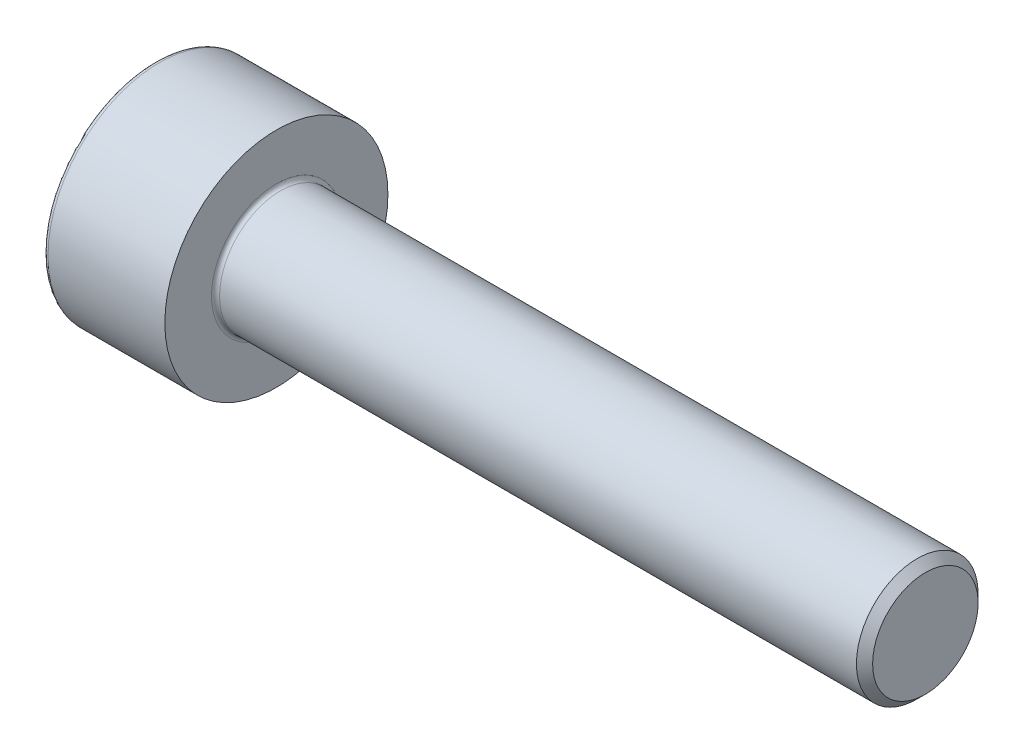
ISO-10303-21;
HEADER;
FILE_DESCRIPTION(('STEP AP214'),'2;1');
FILE_NAME('part.step','',(''),(''),'','','');
FILE_SCHEMA(('AUTOMOTIVE_DESIGN { 1 0 10303 214 1 1 1 1 }'));
ENDSEC;
DATA;
#1=APPLICATION_CONTEXT('core data for automotive mechanical design processes');
#2=APPLICATION_PROTOCOL_DEFINITION('international standard','automotive_design',2000,#1);
#3=PRODUCT_CONTEXT('',#1,'mechanical');
#4=PRODUCT('Part','Part','',(#3));
#5=PRODUCT_RELATED_PRODUCT_CATEGORY('part','',(#4));
#6=PRODUCT_DEFINITION_FORMATION('','',#4);
#7=PRODUCT_DEFINITION_CONTEXT('part definition',#1,'design');
#8=PRODUCT_DEFINITION('design','',#6,#7);
#9=PRODUCT_DEFINITION_SHAPE('','',#8);
#10=(LENGTH_UNIT() NAMED_UNIT(*) SI_UNIT(.MILLI.,.METRE.));
#11=(NAMED_UNIT(*) PLANE_ANGLE_UNIT() SI_UNIT($,.RADIAN.));
#12=(NAMED_UNIT(*) SI_UNIT($,.STERADIAN.) SOLID_ANGLE_UNIT());
#13=UNCERTAINTY_MEASURE_WITH_UNIT(LENGTH_MEASURE(1.E-05),#10,'distance_accuracy_value','');
#14=(GEOMETRIC_REPRESENTATION_CONTEXT(3) GLOBAL_UNCERTAINTY_ASSIGNED_CONTEXT((#13)) GLOBAL_UNIT_ASSIGNED_CONTEXT((#10,
#11,#12)) REPRESENTATION_CONTEXT('',''));
#15=CARTESIAN_POINT('',(0.,0.,0.));
#16=DIRECTION('',(0.,0.,1.));
#17=DIRECTION('',(1.,0.,0.));
#18=AXIS2_PLACEMENT_3D('',#15,#16,#17);
#19=CARTESIAN_POINT('',(19.,0.,0.));
#20=DIRECTION('',(-1.,0.,0.));
#21=DIRECTION('',(0.,0.,1.));
#22=AXIS2_PLACEMENT_3D('',#19,#20,#21);
#23=PLANE('',#22);
#24=CARTESIAN_POINT('',(19.,0.,0.));
#25=DIRECTION('',(-1.,0.,0.));
#26=DIRECTION('',(0.,0.,1.));
#27=AXIS2_PLACEMENT_3D('',#24,#25,#26);
#28=CIRCLE('',#27,1.29999999999999);
#29=CARTESIAN_POINT('',(19.,0.,1.29999999999999));
#30=VERTEX_POINT('',#29);
#31=EDGE_CURVE('E11',#30,#30,#28,.F.);
#32=ORIENTED_EDGE('',*,*,#31,.T.);
#33=EDGE_LOOP('',(#32));
#34=FACE_BOUND('',#33,.T.);
#35=ADVANCED_FACE('F35',(#34),#23,.F.);
#36=CARTESIAN_POINT('',(0.,0.,0.));
#37=DIRECTION('',(-1.,0.,0.));
#38=DIRECTION('',(0.,0.,1.));
#39=AXIS2_PLACEMENT_3D('',#36,#37,#38);
#40=CYLINDRICAL_SURFACE('',#39,1.5);
#41=CARTESIAN_POINT('',(18.8,0.,0.));
#42=DIRECTION('',(-1.,0.,0.));
#43=DIRECTION('',(0.,0.,1.));
#44=AXIS2_PLACEMENT_3D('',#41,#42,#43);
#45=CIRCLE('',#44,1.5);
#46=CARTESIAN_POINT('',(18.8,0.,1.5));
#47=VERTEX_POINT('',#46);
#48=EDGE_CURVE('E43',#47,#47,#45,.T.);
#49=ORIENTED_EDGE('',*,*,#48,.T.);
#50=EDGE_LOOP('',(#49));
#51=FACE_BOUND('',#50,.T.);
#52=CARTESIAN_POINT('',(3.1,0.,0.));
#53=DIRECTION('',(1.,0.,0.));
#54=DIRECTION('',(0.,0.,-1.));
#55=AXIS2_PLACEMENT_3D('',#52,#53,#54);
#56=CIRCLE('',#55,1.5);
#57=CARTESIAN_POINT('',(3.1,0.,-1.5));
#58=VERTEX_POINT('',#57);
#59=EDGE_CURVE('E148',#58,#58,#56,.T.);
#60=ORIENTED_EDGE('',*,*,#59,.T.);
#61=EDGE_LOOP('',(#60));
#62=FACE_BOUND('',#61,.T.);
#63=ADVANCED_FACE('F159',(#51,#62),#40,.T.);
#64=CARTESIAN_POINT('',(3.,0.,0.));
#65=DIRECTION('',(1.,0.,0.));
#66=DIRECTION('',(0.,0.,-1.));
#67=AXIS2_PLACEMENT_3D('',#64,#65,#66);
#68=PLANE('',#67);
#69=CARTESIAN_POINT('',(3.,0.,0.));
#70=DIRECTION('',(1.,0.,0.));
#71=DIRECTION('',(0.,0.,-1.));
#72=AXIS2_PLACEMENT_3D('',#69,#70,#71);
#73=CIRCLE('',#72,1.6);
#74=CARTESIAN_POINT('',(3.,0.,-1.6));
#75=VERTEX_POINT('',#74);
#76=EDGE_CURVE('E145',#75,#75,#73,.F.);
#77=ORIENTED_EDGE('',*,*,#76,.T.);
#78=EDGE_LOOP('',(#77));
#79=FACE_BOUND('',#78,.T.);
#80=CARTESIAN_POINT('',(3.,0.,0.));
#81=DIRECTION('',(-1.,0.,0.));
#82=DIRECTION('',(0.,0.,1.));
#83=AXIS2_PLACEMENT_3D('',#80,#81,#82);
#84=CIRCLE('',#83,2.75);
#85=CARTESIAN_POINT('',(3.,0.,2.75));
#86=VERTEX_POINT('',#85);
#87=EDGE_CURVE('E137',#86,#86,#84,.T.);
#88=ORIENTED_EDGE('',*,*,#87,.F.);
#89=EDGE_LOOP('',(#88));
#90=FACE_BOUND('',#89,.T.);
#91=ADVANCED_FACE('F181',(#79,#90),#68,.T.);
#92=CARTESIAN_POINT('',(0.,0.,0.));
#93=DIRECTION('',(-1.,0.,0.));
#94=DIRECTION('',(0.,0.,1.));
#95=AXIS2_PLACEMENT_3D('',#92,#93,#94);
#96=CYLINDRICAL_SURFACE('',#95,2.75);
#97=CARTESIAN_POINT('',(0.12,0.,0.));
#98=DIRECTION('',(-1.,0.,0.));
#99=DIRECTION('',(0.,0.,1.));
#100=AXIS2_PLACEMENT_3D('',#97,#98,#99);
#101=CIRCLE('',#100,2.75);
#102=CARTESIAN_POINT('',(0.12,0.,2.75));
#103=VERTEX_POINT('',#102);
#104=EDGE_CURVE('E154',#103,#103,#101,.F.);
#105=ORIENTED_EDGE('',*,*,#104,.T.);
#106=EDGE_LOOP('',(#105));
#107=FACE_BOUND('',#106,.T.);
#108=ORIENTED_EDGE('',*,*,#87,.T.);
#109=EDGE_LOOP('',(#108));
#110=FACE_BOUND('',#109,.T.);
#111=ADVANCED_FACE('F191',(#107,#110),#96,.T.);
#112=CARTESIAN_POINT('',(0.,0.,0.));
#113=DIRECTION('',(-1.,0.,0.));
#114=DIRECTION('',(0.,0.,1.));
#115=AXIS2_PLACEMENT_3D('',#112,#113,#114);
#116=PLANE('',#115);
#117=DIRECTION('',(0.,0.5,-0.866025403784439));
#118=VECTOR('',#117,1.);
#119=CARTESIAN_POINT('',(0.,0.721687836487033,1.25));
#120=LINE('',#119,#118);
#121=CARTESIAN_POINT('',(0.,0.721687836487033,1.25));
#122=VERTEX_POINT('',#121);
#123=CARTESIAN_POINT('',(0.,1.44337567297406,0.));
#124=VERTEX_POINT('',#123);
#125=EDGE_CURVE('E50',#122,#124,#120,.T.);
#126=ORIENTED_EDGE('',*,*,#125,.F.);
#127=DIRECTION('',(0.,1.,0.));
#128=VECTOR('',#127,1.);
#129=CARTESIAN_POINT('',(0.,-0.721687836487032,1.25));
#130=LINE('',#129,#128);
#131=CARTESIAN_POINT('',(0.,-0.721687836487032,1.25));
#132=VERTEX_POINT('',#131);
#133=EDGE_CURVE('E133',#132,#122,#130,.T.);
#134=ORIENTED_EDGE('',*,*,#133,.F.);
#135=DIRECTION('',(0.,0.5,0.866025403784439));
#136=VECTOR('',#135,1.);
#137=CARTESIAN_POINT('',(0.,-1.44337567297406,0.));
#138=LINE('',#137,#136);
#139=CARTESIAN_POINT('',(0.,-1.44337567297406,0.));
#140=VERTEX_POINT('',#139);
#141=EDGE_CURVE('E131',#140,#132,#138,.T.);
#142=ORIENTED_EDGE('',*,*,#141,.F.);
#143=DIRECTION('',(0.,-0.5,0.866025403784439));
#144=VECTOR('',#143,1.);
#145=CARTESIAN_POINT('',(0.,-0.721687836487033,-1.25));
#146=LINE('',#145,#144);
#147=CARTESIAN_POINT('',(0.,-0.721687836487033,-1.25));
#148=VERTEX_POINT('',#147);
#149=EDGE_CURVE('E98',#148,#140,#146,.T.);
#150=ORIENTED_EDGE('',*,*,#149,.F.);
#151=DIRECTION('',(0.,-1.,0.));
#152=VECTOR('',#151,1.);
#153=CARTESIAN_POINT('',(0.,0.721687836487032,-1.25));
#154=LINE('',#153,#152);
#155=CARTESIAN_POINT('',(0.,0.721687836487032,-1.25));
#156=VERTEX_POINT('',#155);
#157=EDGE_CURVE('E127',#156,#148,#154,.T.);
#158=ORIENTED_EDGE('',*,*,#157,.F.);
#159=DIRECTION('',(0.,-0.5,-0.866025403784439));
#160=VECTOR('',#159,1.);
#161=CARTESIAN_POINT('',(0.,1.44337567297406,0.));
#162=LINE('',#161,#160);
#163=EDGE_CURVE('E124',#124,#156,#162,.T.);
#164=ORIENTED_EDGE('',*,*,#163,.F.);
#165=EDGE_LOOP('',(#126,#134,#142,#150,#158,#164));
#166=FACE_BOUND('',#165,.T.);
#167=CARTESIAN_POINT('',(0.,0.,0.));
#168=DIRECTION('',(-1.,0.,0.));
#169=DIRECTION('',(0.,0.,1.));
#170=AXIS2_PLACEMENT_3D('',#167,#168,#169);
#171=CIRCLE('',#170,2.63);
#172=CARTESIAN_POINT('',(0.,0.,2.63));
#173=VERTEX_POINT('',#172);
#174=EDGE_CURVE('E151',#173,#173,#171,.T.);
#175=ORIENTED_EDGE('',*,*,#174,.T.);
#176=EDGE_LOOP('',(#175));
#177=FACE_BOUND('',#176,.T.);
#178=ADVANCED_FACE('F186',(#166,#177),#116,.T.);
#179=CARTESIAN_POINT('',(3.1,0.,0.));
#180=DIRECTION('',(1.,0.,0.));
#181=DIRECTION('',(0.,0.,-1.));
#182=AXIS2_PLACEMENT_3D('',#179,#180,#181);
#183=TOROIDAL_SURFACE('',#182,1.6,0.1);
#184=ORIENTED_EDGE('',*,*,#59,.F.);
#185=EDGE_LOOP('',(#184));
#186=FACE_BOUND('',#185,.T.);
#187=ORIENTED_EDGE('',*,*,#76,.F.);
#188=EDGE_LOOP('',(#187));
#189=FACE_BOUND('',#188,.T.);
#190=ADVANCED_FACE('F172',(#186,#189),#183,.F.);
#191=CARTESIAN_POINT('',(0.12,0.,0.));
#192=DIRECTION('',(-1.,0.,0.));
#193=DIRECTION('',(0.,0.,1.));
#194=AXIS2_PLACEMENT_3D('',#191,#192,#193);
#195=TOROIDAL_SURFACE('',#194,2.63,0.12);
#196=ORIENTED_EDGE('',*,*,#104,.F.);
#197=EDGE_LOOP('',(#196));
#198=FACE_BOUND('',#197,.T.);
#199=ORIENTED_EDGE('',*,*,#174,.F.);
#200=EDGE_LOOP('',(#199));
#201=FACE_BOUND('',#200,.T.);
#202=ADVANCED_FACE('F164',(#198,#201),#195,.T.);
#203=CARTESIAN_POINT('',(18.8,0.,0.));
#204=DIRECTION('',(-1.,0.,0.));
#205=DIRECTION('',(0.,0.,1.));
#206=AXIS2_PLACEMENT_3D('',#203,#204,#205);
#207=CONICAL_SURFACE('',#206,1.5,0.785398163397448);
#208=ORIENTED_EDGE('',*,*,#31,.F.);
#209=EDGE_LOOP('',(#208));
#210=FACE_BOUND('',#209,.T.);
#211=ORIENTED_EDGE('',*,*,#48,.F.);
#212=EDGE_LOOP('',(#211));
#213=FACE_BOUND('',#212,.T.);
#214=ADVANCED_FACE('F37',(#210,#213),#207,.T.);
#215=CARTESIAN_POINT('',(1.3,0.721687836487033,1.25));
#216=DIRECTION('',(0.,0.866025403784439,0.5));
#217=DIRECTION('',(0.,-0.5,0.866025403784439));
#218=AXIS2_PLACEMENT_3D('',#215,#216,#217);
#219=PLANE('',#218);
#220=ORIENTED_EDGE('',*,*,#125,.T.);
#221=DIRECTION('',(-1.,0.,0.));
#222=VECTOR('',#221,1.);
#223=CARTESIAN_POINT('',(1.3,1.44337567297406,0.));
#224=LINE('',#223,#222);
#225=CARTESIAN_POINT('',(1.3,1.44337567297406,0.));
#226=VERTEX_POINT('',#225);
#227=EDGE_CURVE('E80',#226,#124,#224,.T.);
#228=ORIENTED_EDGE('',*,*,#227,.F.);
#229=DIRECTION('',(0.,0.5,-0.866025403784439));
#230=VECTOR('',#229,1.);
#231=CARTESIAN_POINT('',(1.3,0.721687836487033,1.25));
#232=LINE('',#231,#230);
#233=CARTESIAN_POINT('',(1.3,0.721687836487033,1.25));
#234=VERTEX_POINT('',#233);
#235=EDGE_CURVE('E135',#234,#226,#232,.T.);
#236=ORIENTED_EDGE('',*,*,#235,.F.);
#237=DIRECTION('',(-1.,0.,0.));
#238=VECTOR('',#237,1.);
#239=CARTESIAN_POINT('',(1.3,0.721687836487033,1.25));
#240=LINE('',#239,#238);
#241=EDGE_CURVE('E58',#234,#122,#240,.T.);
#242=ORIENTED_EDGE('',*,*,#241,.T.);
#243=EDGE_LOOP('',(#220,#228,#236,#242));
#244=FACE_BOUND('',#243,.T.);
#245=ADVANCED_FACE('F163',(#244),#219,.F.);
#246=CARTESIAN_POINT('',(1.3,-0.721687836487032,1.25));
#247=DIRECTION('',(0.,0.,1.));
#248=DIRECTION('',(0.,-1.,0.));
#249=AXIS2_PLACEMENT_3D('',#246,#247,#248);
#250=PLANE('',#249);
#251=ORIENTED_EDGE('',*,*,#133,.T.);
#252=ORIENTED_EDGE('',*,*,#241,.F.);
#253=DIRECTION('',(0.,1.,0.));
#254=VECTOR('',#253,1.);
#255=CARTESIAN_POINT('',(1.3,-0.721687836487032,1.25));
#256=LINE('',#255,#254);
#257=CARTESIAN_POINT('',(1.3,-0.721687836487032,1.25));
#258=VERTEX_POINT('',#257);
#259=EDGE_CURVE('E110',#258,#234,#256,.T.);
#260=ORIENTED_EDGE('',*,*,#259,.F.);
#261=DIRECTION('',(-1.,0.,0.));
#262=VECTOR('',#261,1.);
#263=CARTESIAN_POINT('',(1.3,-0.721687836487032,1.25));
#264=LINE('',#263,#262);
#265=EDGE_CURVE('E102',#258,#132,#264,.T.);
#266=ORIENTED_EDGE('',*,*,#265,.T.);
#267=EDGE_LOOP('',(#251,#252,#260,#266));
#268=FACE_BOUND('',#267,.T.);
#269=ADVANCED_FACE('F170',(#268),#250,.F.);
#270=CARTESIAN_POINT('',(1.3,-1.44337567297406,0.));
#271=DIRECTION('',(0.,-0.866025403784439,0.5));
#272=DIRECTION('',(0.,-0.5,-0.866025403784439));
#273=AXIS2_PLACEMENT_3D('',#270,#271,#272);
#274=PLANE('',#273);
#275=ORIENTED_EDGE('',*,*,#141,.T.);
#276=ORIENTED_EDGE('',*,*,#265,.F.);
#277=DIRECTION('',(0.,0.5,0.866025403784439));
#278=VECTOR('',#277,1.);
#279=CARTESIAN_POINT('',(1.3,-1.44337567297406,0.));
#280=LINE('',#279,#278);
#281=CARTESIAN_POINT('',(1.3,-1.44337567297406,0.));
#282=VERTEX_POINT('',#281);
#283=EDGE_CURVE('E106',#282,#258,#280,.T.);
#284=ORIENTED_EDGE('',*,*,#283,.F.);
#285=DIRECTION('',(-1.,0.,0.));
#286=VECTOR('',#285,1.);
#287=CARTESIAN_POINT('',(1.3,-1.44337567297406,0.));
#288=LINE('',#287,#286);
#289=EDGE_CURVE('E91',#282,#140,#288,.T.);
#290=ORIENTED_EDGE('',*,*,#289,.T.);
#291=EDGE_LOOP('',(#275,#276,#284,#290));
#292=FACE_BOUND('',#291,.T.);
#293=ADVANCED_FACE('F107',(#292),#274,.F.);
#294=CARTESIAN_POINT('',(1.3,-0.721687836487033,-1.25));
#295=DIRECTION('',(0.,-0.866025403784439,-0.5));
#296=DIRECTION('',(0.,0.5,-0.866025403784439));
#297=AXIS2_PLACEMENT_3D('',#294,#295,#296);
#298=PLANE('',#297);
#299=ORIENTED_EDGE('',*,*,#149,.T.);
#300=ORIENTED_EDGE('',*,*,#289,.F.);
#301=DIRECTION('',(0.,-0.5,0.866025403784439));
#302=VECTOR('',#301,1.);
#303=CARTESIAN_POINT('',(1.3,-0.721687836487033,-1.25));
#304=LINE('',#303,#302);
#305=CARTESIAN_POINT('',(1.3,-0.721687836487033,-1.25));
#306=VERTEX_POINT('',#305);
#307=EDGE_CURVE('E95',#306,#282,#304,.T.);
#308=ORIENTED_EDGE('',*,*,#307,.F.);
#309=DIRECTION('',(-1.,0.,0.));
#310=VECTOR('',#309,1.);
#311=CARTESIAN_POINT('',(1.3,-0.721687836487033,-1.25));
#312=LINE('',#311,#310);
#313=EDGE_CURVE('E103',#306,#148,#312,.T.);
#314=ORIENTED_EDGE('',*,*,#313,.T.);
#315=EDGE_LOOP('',(#299,#300,#308,#314));
#316=FACE_BOUND('',#315,.T.);
#317=ADVANCED_FACE('F93',(#316),#298,.F.);
#318=CARTESIAN_POINT('',(1.3,0.721687836487032,-1.25));
#319=DIRECTION('',(0.,0.,-1.));
#320=DIRECTION('',(0.,1.,0.));
#321=AXIS2_PLACEMENT_3D('',#318,#319,#320);
#322=PLANE('',#321);
#323=ORIENTED_EDGE('',*,*,#157,.T.);
#324=ORIENTED_EDGE('',*,*,#313,.F.);
#325=DIRECTION('',(0.,-1.,0.));
#326=VECTOR('',#325,1.);
#327=CARTESIAN_POINT('',(1.3,0.721687836487032,-1.25));
#328=LINE('',#327,#326);
#329=CARTESIAN_POINT('',(1.3,0.721687836487032,-1.25));
#330=VERTEX_POINT('',#329);
#331=EDGE_CURVE('E116',#330,#306,#328,.T.);
#332=ORIENTED_EDGE('',*,*,#331,.F.);
#333=DIRECTION('',(-1.,0.,0.));
#334=VECTOR('',#333,1.);
#335=CARTESIAN_POINT('',(1.3,0.721687836487032,-1.25));
#336=LINE('',#335,#334);
#337=EDGE_CURVE('E140',#330,#156,#336,.T.);
#338=ORIENTED_EDGE('',*,*,#337,.T.);
#339=EDGE_LOOP('',(#323,#324,#332,#338));
#340=FACE_BOUND('',#339,.T.);
#341=ADVANCED_FACE('F211',(#340),#322,.F.);
#342=CARTESIAN_POINT('',(1.3,1.44337567297406,0.));
#343=DIRECTION('',(0.,0.866025403784439,-0.5));
#344=DIRECTION('',(0.,0.5,0.866025403784439));
#345=AXIS2_PLACEMENT_3D('',#342,#343,#344);
#346=PLANE('',#345);
#347=ORIENTED_EDGE('',*,*,#163,.T.);
#348=ORIENTED_EDGE('',*,*,#337,.F.);
#349=DIRECTION('',(0.,-0.5,-0.866025403784439));
#350=VECTOR('',#349,1.);
#351=CARTESIAN_POINT('',(1.3,1.44337567297406,0.));
#352=LINE('',#351,#350);
#353=EDGE_CURVE('E118',#226,#330,#352,.T.);
#354=ORIENTED_EDGE('',*,*,#353,.F.);
#355=ORIENTED_EDGE('',*,*,#227,.T.);
#356=EDGE_LOOP('',(#347,#348,#354,#355));
#357=FACE_BOUND('',#356,.T.);
#358=ADVANCED_FACE('F208',(#357),#346,.F.);
#359=CARTESIAN_POINT('',(1.3,0.,0.));
#360=DIRECTION('',(-1.,0.,0.));
#361=DIRECTION('',(0.,0.,1.));
#362=AXIS2_PLACEMENT_3D('',#359,#360,#361);
#363=PLANE('',#362);
#364=ORIENTED_EDGE('',*,*,#235,.T.);
#365=ORIENTED_EDGE('',*,*,#353,.T.);
#366=ORIENTED_EDGE('',*,*,#331,.T.);
#367=ORIENTED_EDGE('',*,*,#307,.T.);
#368=ORIENTED_EDGE('',*,*,#283,.T.);
#369=ORIENTED_EDGE('',*,*,#259,.T.);
#370=EDGE_LOOP('',(#364,#365,#366,#367,#368,#369));
#371=FACE_BOUND('',#370,.T.);
#372=ADVANCED_FACE('F113',(#371),#363,.T.);
#373=CLOSED_SHELL('',(#35,#63,#91,#111,#178,#190,#202,#214,#245,#269,#293,#317,#341,#358,#372));
#374=MANIFOLD_SOLID_BREP('B2',#373);
#375=ADVANCED_BREP_SHAPE_REPRESENTATION('',(#18,#374),#14);
#376=SHAPE_DEFINITION_REPRESENTATION(#9,#375);
ENDSEC;
END-ISO-10303-21;
